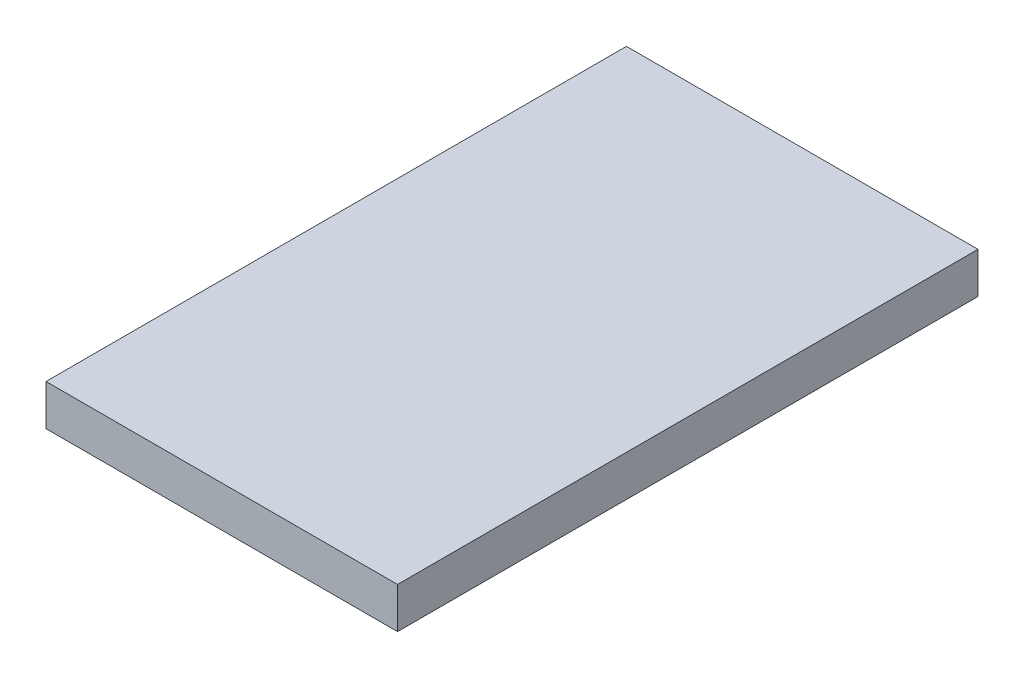
ISO-10303-21;
HEADER;
FILE_DESCRIPTION(('STEP AP214'),'2;1');
FILE_NAME('part.step','',(''),(''),'','','');
FILE_SCHEMA(('AUTOMOTIVE_DESIGN { 1 0 10303 214 1 1 1 1 }'));
ENDSEC;
DATA;
#1=APPLICATION_CONTEXT('core data for automotive mechanical design processes');
#2=APPLICATION_PROTOCOL_DEFINITION('international standard','automotive_design',2000,#1);
#3=PRODUCT_CONTEXT('',#1,'mechanical');
#4=PRODUCT('Part','Part','',(#3));
#5=PRODUCT_RELATED_PRODUCT_CATEGORY('part','',(#4));
#6=PRODUCT_DEFINITION_FORMATION('','',#4);
#7=PRODUCT_DEFINITION_CONTEXT('part definition',#1,'design');
#8=PRODUCT_DEFINITION('design','',#6,#7);
#9=PRODUCT_DEFINITION_SHAPE('','',#8);
#10=(LENGTH_UNIT() NAMED_UNIT(*) SI_UNIT(.MILLI.,.METRE.));
#11=(NAMED_UNIT(*) PLANE_ANGLE_UNIT() SI_UNIT($,.RADIAN.));
#12=(NAMED_UNIT(*) SI_UNIT($,.STERADIAN.) SOLID_ANGLE_UNIT());
#13=UNCERTAINTY_MEASURE_WITH_UNIT(LENGTH_MEASURE(1.E-05),#10,'distance_accuracy_value','');
#14=(GEOMETRIC_REPRESENTATION_CONTEXT(3) GLOBAL_UNCERTAINTY_ASSIGNED_CONTEXT((#13)) GLOBAL_UNIT_ASSIGNED_CONTEXT((#10,
#11,#12)) REPRESENTATION_CONTEXT('',''));
#15=CARTESIAN_POINT('',(0.,0.,0.));
#16=DIRECTION('',(0.,0.,1.));
#17=DIRECTION('',(1.,0.,0.));
#18=AXIS2_PLACEMENT_3D('',#15,#16,#17);
#19=CARTESIAN_POINT('',(0.,6.35,0.));
#20=DIRECTION('',(-1.,0.,0.));
#21=DIRECTION('',(0.,0.,1.));
#22=AXIS2_PLACEMENT_3D('',#19,#20,#21);
#23=PLANE('',#22);
#24=DIRECTION('',(0.,0.,-1.));
#25=VECTOR('',#24,1.);
#26=CARTESIAN_POINT('',(0.,0.,0.));
#27=LINE('',#26,#25);
#28=CARTESIAN_POINT('',(0.,0.,0.));
#29=VERTEX_POINT('',#28);
#30=CARTESIAN_POINT('',(0.,0.,-90.17));
#31=VERTEX_POINT('',#30);
#32=EDGE_CURVE('E97',#29,#31,#27,.T.);
#33=ORIENTED_EDGE('',*,*,#32,.T.);
#34=DIRECTION('',(0.,-1.,0.));
#35=VECTOR('',#34,1.);
#36=CARTESIAN_POINT('',(0.,6.35,-90.17));
#37=LINE('',#36,#35);
#38=CARTESIAN_POINT('',(0.,6.35,-90.17));
#39=VERTEX_POINT('',#38);
#40=EDGE_CURVE('E11',#39,#31,#37,.T.);
#41=ORIENTED_EDGE('',*,*,#40,.F.);
#42=DIRECTION('',(0.,0.,-1.));
#43=VECTOR('',#42,1.);
#44=CARTESIAN_POINT('',(0.,6.35,0.));
#45=LINE('',#44,#43);
#46=CARTESIAN_POINT('',(0.,6.35,0.));
#47=VERTEX_POINT('',#46);
#48=EDGE_CURVE('E85',#47,#39,#45,.T.);
#49=ORIENTED_EDGE('',*,*,#48,.F.);
#50=DIRECTION('',(0.,-1.,0.));
#51=VECTOR('',#50,1.);
#52=CARTESIAN_POINT('',(0.,6.35,0.));
#53=LINE('',#52,#51);
#54=EDGE_CURVE('E93',#47,#29,#53,.T.);
#55=ORIENTED_EDGE('',*,*,#54,.T.);
#56=EDGE_LOOP('',(#33,#41,#49,#55));
#57=FACE_BOUND('',#56,.T.);
#58=ADVANCED_FACE('F34',(#57),#23,.F.);
#59=CARTESIAN_POINT('',(0.,6.35,-90.17));
#60=DIRECTION('',(0.,0.,1.));
#61=DIRECTION('',(1.,0.,0.));
#62=AXIS2_PLACEMENT_3D('',#59,#60,#61);
#63=PLANE('',#62);
#64=DIRECTION('',(-1.,0.,0.));
#65=VECTOR('',#64,1.);
#66=CARTESIAN_POINT('',(0.,0.,-90.17));
#67=LINE('',#66,#65);
#68=CARTESIAN_POINT('',(-54.61,0.,-90.17));
#69=VERTEX_POINT('',#68);
#70=EDGE_CURVE('E89',#31,#69,#67,.T.);
#71=ORIENTED_EDGE('',*,*,#70,.T.);
#72=DIRECTION('',(0.,-1.,0.));
#73=VECTOR('',#72,1.);
#74=CARTESIAN_POINT('',(-54.61,6.35,-90.17));
#75=LINE('',#74,#73);
#76=CARTESIAN_POINT('',(-54.61,6.35,-90.17));
#77=VERTEX_POINT('',#76);
#78=EDGE_CURVE('E42',#77,#69,#75,.T.);
#79=ORIENTED_EDGE('',*,*,#78,.F.);
#80=DIRECTION('',(-1.,0.,0.));
#81=VECTOR('',#80,1.);
#82=CARTESIAN_POINT('',(0.,6.35,-90.17));
#83=LINE('',#82,#81);
#84=EDGE_CURVE('E80',#39,#77,#83,.T.);
#85=ORIENTED_EDGE('',*,*,#84,.F.);
#86=ORIENTED_EDGE('',*,*,#40,.T.);
#87=EDGE_LOOP('',(#71,#79,#85,#86));
#88=FACE_BOUND('',#87,.T.);
#89=ADVANCED_FACE('F88',(#88),#63,.F.);
#90=CARTESIAN_POINT('',(-54.61,6.35,0.));
#91=DIRECTION('',(1.,0.,0.));
#92=DIRECTION('',(0.,0.,-1.));
#93=AXIS2_PLACEMENT_3D('',#90,#91,#92);
#94=PLANE('',#93);
#95=DIRECTION('',(0.,0.,1.));
#96=VECTOR('',#95,1.);
#97=CARTESIAN_POINT('',(-54.61,0.,0.));
#98=LINE('',#97,#96);
#99=CARTESIAN_POINT('',(-54.61,0.,0.));
#100=VERTEX_POINT('',#99);
#101=EDGE_CURVE('E67',#69,#100,#98,.T.);
#102=ORIENTED_EDGE('',*,*,#101,.T.);
#103=DIRECTION('',(0.,-1.,0.));
#104=VECTOR('',#103,1.);
#105=CARTESIAN_POINT('',(-54.61,6.35,0.));
#106=LINE('',#105,#104);
#107=CARTESIAN_POINT('',(-54.61,6.35,0.));
#108=VERTEX_POINT('',#107);
#109=EDGE_CURVE('E90',#108,#100,#106,.T.);
#110=ORIENTED_EDGE('',*,*,#109,.F.);
#111=DIRECTION('',(0.,0.,1.));
#112=VECTOR('',#111,1.);
#113=CARTESIAN_POINT('',(-54.61,6.35,0.));
#114=LINE('',#113,#112);
#115=EDGE_CURVE('E83',#77,#108,#114,.T.);
#116=ORIENTED_EDGE('',*,*,#115,.F.);
#117=ORIENTED_EDGE('',*,*,#78,.T.);
#118=EDGE_LOOP('',(#102,#110,#116,#117));
#119=FACE_BOUND('',#118,.T.);
#120=ADVANCED_FACE('F91',(#119),#94,.F.);
#121=CARTESIAN_POINT('',(0.,6.35,0.));
#122=DIRECTION('',(0.,0.,-1.));
#123=DIRECTION('',(-1.,0.,0.));
#124=AXIS2_PLACEMENT_3D('',#121,#122,#123);
#125=PLANE('',#124);
#126=DIRECTION('',(1.,0.,0.));
#127=VECTOR('',#126,1.);
#128=CARTESIAN_POINT('',(0.,0.,0.));
#129=LINE('',#128,#127);
#130=EDGE_CURVE('E73',#100,#29,#129,.T.);
#131=ORIENTED_EDGE('',*,*,#130,.T.);
#132=ORIENTED_EDGE('',*,*,#54,.F.);
#133=DIRECTION('',(1.,0.,0.));
#134=VECTOR('',#133,1.);
#135=CARTESIAN_POINT('',(0.,6.35,0.));
#136=LINE('',#135,#134);
#137=EDGE_CURVE('E50',#108,#47,#136,.T.);
#138=ORIENTED_EDGE('',*,*,#137,.F.);
#139=ORIENTED_EDGE('',*,*,#109,.T.);
#140=EDGE_LOOP('',(#131,#132,#138,#139));
#141=FACE_BOUND('',#140,.T.);
#142=ADVANCED_FACE('F104',(#141),#125,.F.);
#143=CARTESIAN_POINT('',(0.,6.35,0.));
#144=DIRECTION('',(0.,1.,0.));
#145=DIRECTION('',(0.,0.,1.));
#146=AXIS2_PLACEMENT_3D('',#143,#144,#145);
#147=PLANE('',#146);
#148=ORIENTED_EDGE('',*,*,#48,.T.);
#149=ORIENTED_EDGE('',*,*,#84,.T.);
#150=ORIENTED_EDGE('',*,*,#115,.T.);
#151=ORIENTED_EDGE('',*,*,#137,.T.);
#152=EDGE_LOOP('',(#148,#149,#150,#151));
#153=FACE_BOUND('',#152,.T.);
#154=ADVANCED_FACE('F81',(#153),#147,.T.);
#155=CARTESIAN_POINT('',(0.,0.,0.));
#156=DIRECTION('',(0.,1.,0.));
#157=DIRECTION('',(0.,0.,1.));
#158=AXIS2_PLACEMENT_3D('',#155,#156,#157);
#159=PLANE('',#158);
#160=ORIENTED_EDGE('',*,*,#32,.F.);
#161=ORIENTED_EDGE('',*,*,#130,.F.);
#162=ORIENTED_EDGE('',*,*,#101,.F.);
#163=ORIENTED_EDGE('',*,*,#70,.F.);
#164=EDGE_LOOP('',(#160,#161,#162,#163));
#165=FACE_BOUND('',#164,.T.);
#166=ADVANCED_FACE('F107',(#165),#159,.F.);
#167=CLOSED_SHELL('',(#58,#89,#120,#142,#154,#166));
#168=MANIFOLD_SOLID_BREP('B2',#167);
#169=ADVANCED_BREP_SHAPE_REPRESENTATION('',(#18,#168),#14);
#170=SHAPE_DEFINITION_REPRESENTATION(#9,#169);
ENDSEC;
END-ISO-10303-21;
